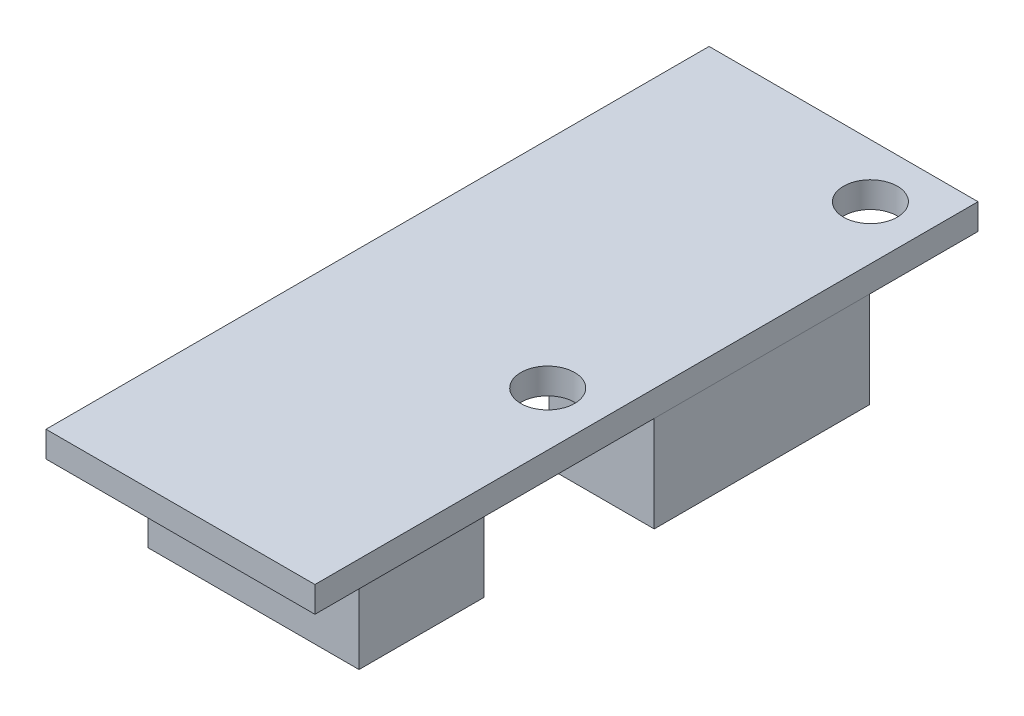
ISO-10303-21;
HEADER;
FILE_DESCRIPTION(('STEP AP214'),'2;1');
FILE_NAME('part.step','',(''),(''),'','','');
FILE_SCHEMA(('AUTOMOTIVE_DESIGN { 1 0 10303 214 1 1 1 1 }'));
ENDSEC;
DATA;
#1=APPLICATION_CONTEXT('core data for automotive mechanical design processes');
#2=APPLICATION_PROTOCOL_DEFINITION('international standard','automotive_design',2000,#1);
#3=PRODUCT_CONTEXT('',#1,'mechanical');
#4=PRODUCT('Part','Part','',(#3));
#5=PRODUCT_RELATED_PRODUCT_CATEGORY('part','',(#4));
#6=PRODUCT_DEFINITION_FORMATION('','',#4);
#7=PRODUCT_DEFINITION_CONTEXT('part definition',#1,'design');
#8=PRODUCT_DEFINITION('design','',#6,#7);
#9=PRODUCT_DEFINITION_SHAPE('','',#8);
#10=(LENGTH_UNIT() NAMED_UNIT(*) SI_UNIT(.MILLI.,.METRE.));
#11=(NAMED_UNIT(*) PLANE_ANGLE_UNIT() SI_UNIT($,.RADIAN.));
#12=(NAMED_UNIT(*) SI_UNIT($,.STERADIAN.) SOLID_ANGLE_UNIT());
#13=UNCERTAINTY_MEASURE_WITH_UNIT(LENGTH_MEASURE(1.E-05),#10,'distance_accuracy_value','');
#14=(GEOMETRIC_REPRESENTATION_CONTEXT(3) GLOBAL_UNCERTAINTY_ASSIGNED_CONTEXT((#13)) GLOBAL_UNIT_ASSIGNED_CONTEXT((#10,
#11,#12)) REPRESENTATION_CONTEXT('',''));
#15=CARTESIAN_POINT('',(0.,0.,0.));
#16=DIRECTION('',(0.,0.,1.));
#17=DIRECTION('',(1.,0.,0.));
#18=AXIS2_PLACEMENT_3D('',#15,#16,#17);
#19=CARTESIAN_POINT('',(-7.93749999999999,1.524,0.));
#20=DIRECTION('',(-1.,0.,0.));
#21=DIRECTION('',(0.,0.,1.));
#22=AXIS2_PLACEMENT_3D('',#19,#20,#21);
#23=PLANE('',#22);
#24=DIRECTION('',(0.,0.,-1.));
#25=VECTOR('',#24,1.);
#26=CARTESIAN_POINT('',(-7.93749999999999,0.,0.));
#27=LINE('',#26,#25);
#28=CARTESIAN_POINT('',(-7.93749999999999,0.,16.9164));
#29=VERTEX_POINT('',#28);
#30=CARTESIAN_POINT('',(-7.9375,0.,-22.225));
#31=VERTEX_POINT('',#30);
#32=EDGE_CURVE('E211',#29,#31,#27,.T.);
#33=ORIENTED_EDGE('',*,*,#32,.F.);
#34=DIRECTION('',(0.,-1.,0.));
#35=VECTOR('',#34,1.);
#36=CARTESIAN_POINT('',(-7.93749999999999,1.524,16.9164));
#37=LINE('',#36,#35);
#38=CARTESIAN_POINT('',(-7.93749999999999,1.524,16.9164));
#39=VERTEX_POINT('',#38);
#40=EDGE_CURVE('E11',#39,#29,#37,.T.);
#41=ORIENTED_EDGE('',*,*,#40,.F.);
#42=DIRECTION('',(0.,0.,-1.));
#43=VECTOR('',#42,1.);
#44=CARTESIAN_POINT('',(-7.93749999999999,1.524,0.));
#45=LINE('',#44,#43);
#46=CARTESIAN_POINT('',(-7.9375,1.524,-22.225));
#47=VERTEX_POINT('',#46);
#48=EDGE_CURVE('E194',#39,#47,#45,.T.);
#49=ORIENTED_EDGE('',*,*,#48,.T.);
#50=DIRECTION('',(0.,-1.,0.));
#51=VECTOR('',#50,1.);
#52=CARTESIAN_POINT('',(-7.9375,1.524,-22.225));
#53=LINE('',#52,#51);
#54=EDGE_CURVE('E205',#47,#31,#53,.T.);
#55=ORIENTED_EDGE('',*,*,#54,.T.);
#56=EDGE_LOOP('',(#33,#41,#49,#55));
#57=FACE_BOUND('',#56,.T.);
#58=ADVANCED_FACE('F32',(#57),#23,.T.);
#59=CARTESIAN_POINT('',(0.,1.524,16.9164));
#60=DIRECTION('',(0.,0.,-1.));
#61=DIRECTION('',(-1.,0.,0.));
#62=AXIS2_PLACEMENT_3D('',#59,#60,#61);
#63=PLANE('',#62);
#64=DIRECTION('',(1.,0.,0.));
#65=VECTOR('',#64,1.);
#66=CARTESIAN_POINT('',(0.,0.,16.9164));
#67=LINE('',#66,#65);
#68=CARTESIAN_POINT('',(7.9375,0.,16.9164));
#69=VERTEX_POINT('',#68);
#70=EDGE_CURVE('E214',#29,#69,#67,.T.);
#71=ORIENTED_EDGE('',*,*,#70,.T.);
#72=DIRECTION('',(0.,-1.,0.));
#73=VECTOR('',#72,1.);
#74=CARTESIAN_POINT('',(7.9375,1.524,16.9164));
#75=LINE('',#74,#73);
#76=CARTESIAN_POINT('',(7.9375,1.524,16.9164));
#77=VERTEX_POINT('',#76);
#78=EDGE_CURVE('E40',#77,#69,#75,.T.);
#79=ORIENTED_EDGE('',*,*,#78,.F.);
#80=DIRECTION('',(1.,0.,0.));
#81=VECTOR('',#80,1.);
#82=CARTESIAN_POINT('',(0.,1.524,16.9164));
#83=LINE('',#82,#81);
#84=EDGE_CURVE('E197',#39,#77,#83,.T.);
#85=ORIENTED_EDGE('',*,*,#84,.F.);
#86=ORIENTED_EDGE('',*,*,#40,.T.);
#87=EDGE_LOOP('',(#71,#79,#85,#86));
#88=FACE_BOUND('',#87,.T.);
#89=ADVANCED_FACE('F232',(#88),#63,.F.);
#90=CARTESIAN_POINT('',(7.9375,1.524,0.));
#91=DIRECTION('',(-1.,0.,0.));
#92=DIRECTION('',(0.,0.,1.));
#93=AXIS2_PLACEMENT_3D('',#90,#91,#92);
#94=PLANE('',#93);
#95=DIRECTION('',(0.,0.,-1.));
#96=VECTOR('',#95,1.);
#97=CARTESIAN_POINT('',(7.9375,0.,0.));
#98=LINE('',#97,#96);
#99=CARTESIAN_POINT('',(7.9375,0.,-22.225));
#100=VERTEX_POINT('',#99);
#101=EDGE_CURVE('E217',#69,#100,#98,.T.);
#102=ORIENTED_EDGE('',*,*,#101,.T.);
#103=DIRECTION('',(0.,-1.,0.));
#104=VECTOR('',#103,1.);
#105=CARTESIAN_POINT('',(7.9375,1.524,-22.225));
#106=LINE('',#105,#104);
#107=CARTESIAN_POINT('',(7.9375,1.524,-22.225));
#108=VERTEX_POINT('',#107);
#109=EDGE_CURVE('E223',#108,#100,#106,.T.);
#110=ORIENTED_EDGE('',*,*,#109,.F.);
#111=DIRECTION('',(0.,0.,-1.));
#112=VECTOR('',#111,1.);
#113=CARTESIAN_POINT('',(7.9375,1.524,0.));
#114=LINE('',#113,#112);
#115=EDGE_CURVE('E200',#77,#108,#114,.T.);
#116=ORIENTED_EDGE('',*,*,#115,.F.);
#117=ORIENTED_EDGE('',*,*,#78,.T.);
#118=EDGE_LOOP('',(#102,#110,#116,#117));
#119=FACE_BOUND('',#118,.T.);
#120=ADVANCED_FACE('F227',(#119),#94,.F.);
#121=CARTESIAN_POINT('',(4.76250000000001,1.524,-19.05));
#122=DIRECTION('',(0.,-1.,0.));
#123=DIRECTION('',(0.,0.,-1.));
#124=AXIS2_PLACEMENT_3D('',#121,#122,#123);
#125=CYLINDRICAL_SURFACE('',#124,1.5875);
#126=CARTESIAN_POINT('',(4.76250000000001,1.524,-19.05));
#127=DIRECTION('',(0.,1.,0.));
#128=DIRECTION('',(0.,0.,1.));
#129=AXIS2_PLACEMENT_3D('',#126,#127,#128);
#130=CIRCLE('',#129,1.5875);
#131=CARTESIAN_POINT('',(4.76250000000001,1.524,-17.4625));
#132=VERTEX_POINT('',#131);
#133=EDGE_CURVE('E190',#132,#132,#130,.T.);
#134=ORIENTED_EDGE('',*,*,#133,.T.);
#135=EDGE_LOOP('',(#134));
#136=FACE_BOUND('',#135,.T.);
#137=CARTESIAN_POINT('',(4.76250000000001,0.,-19.05));
#138=DIRECTION('',(0.,1.,0.));
#139=DIRECTION('',(0.,0.,1.));
#140=AXIS2_PLACEMENT_3D('',#137,#138,#139);
#141=CIRCLE('',#140,1.5875);
#142=CARTESIAN_POINT('',(4.76250000000001,0.,-17.4625));
#143=VERTEX_POINT('',#142);
#144=EDGE_CURVE('E208',#143,#143,#141,.T.);
#145=ORIENTED_EDGE('',*,*,#144,.F.);
#146=EDGE_LOOP('',(#145));
#147=FACE_BOUND('',#146,.T.);
#148=ADVANCED_FACE('F264',(#136,#147),#125,.F.);
#149=CARTESIAN_POINT('',(4.76250000000001,1.524,0.));
#150=DIRECTION('',(0.,-1.,0.));
#151=DIRECTION('',(0.,0.,-1.));
#152=AXIS2_PLACEMENT_3D('',#149,#150,#151);
#153=CYLINDRICAL_SURFACE('',#152,1.5875);
#154=CARTESIAN_POINT('',(4.76250000000001,1.524,0.));
#155=DIRECTION('',(0.,1.,0.));
#156=DIRECTION('',(0.,0.,1.));
#157=AXIS2_PLACEMENT_3D('',#154,#155,#156);
#158=CIRCLE('',#157,1.5875);
#159=CARTESIAN_POINT('',(4.76250000000001,1.524,1.58750000000001));
#160=VERTEX_POINT('',#159);
#161=EDGE_CURVE('E187',#160,#160,#158,.T.);
#162=ORIENTED_EDGE('',*,*,#161,.T.);
#163=EDGE_LOOP('',(#162));
#164=FACE_BOUND('',#163,.T.);
#165=CARTESIAN_POINT('',(4.76250000000001,0.,0.));
#166=DIRECTION('',(0.,1.,0.));
#167=DIRECTION('',(0.,0.,1.));
#168=AXIS2_PLACEMENT_3D('',#165,#166,#167);
#169=CIRCLE('',#168,1.5875);
#170=CARTESIAN_POINT('',(4.76250000000001,0.,1.58750000000001));
#171=VERTEX_POINT('',#170);
#172=EDGE_CURVE('E179',#171,#171,#169,.T.);
#173=ORIENTED_EDGE('',*,*,#172,.F.);
#174=EDGE_LOOP('',(#173));
#175=FACE_BOUND('',#174,.T.);
#176=ADVANCED_FACE('F34',(#164,#175),#153,.F.);
#177=CARTESIAN_POINT('',(0.,1.524,-22.225));
#178=DIRECTION('',(0.,0.,-1.));
#179=DIRECTION('',(-1.,0.,0.));
#180=AXIS2_PLACEMENT_3D('',#177,#178,#179);
#181=PLANE('',#180);
#182=DIRECTION('',(1.,0.,0.));
#183=VECTOR('',#182,1.);
#184=CARTESIAN_POINT('',(0.,0.,-22.225));
#185=LINE('',#184,#183);
#186=EDGE_CURVE('E191',#31,#100,#185,.T.);
#187=ORIENTED_EDGE('',*,*,#186,.F.);
#188=ORIENTED_EDGE('',*,*,#54,.F.);
#189=DIRECTION('',(1.,0.,0.));
#190=VECTOR('',#189,1.);
#191=CARTESIAN_POINT('',(0.,1.524,-22.225));
#192=LINE('',#191,#190);
#193=EDGE_CURVE('E202',#47,#108,#192,.T.);
#194=ORIENTED_EDGE('',*,*,#193,.T.);
#195=ORIENTED_EDGE('',*,*,#109,.T.);
#196=EDGE_LOOP('',(#187,#188,#194,#195));
#197=FACE_BOUND('',#196,.T.);
#198=ADVANCED_FACE('F241',(#197),#181,.T.);
#199=CARTESIAN_POINT('',(0.,1.524,0.));
#200=DIRECTION('',(0.,1.,0.));
#201=DIRECTION('',(0.,0.,1.));
#202=AXIS2_PLACEMENT_3D('',#199,#200,#201);
#203=PLANE('',#202);
#204=ORIENTED_EDGE('',*,*,#161,.F.);
#205=EDGE_LOOP('',(#204));
#206=FACE_BOUND('',#205,.T.);
#207=ORIENTED_EDGE('',*,*,#133,.F.);
#208=EDGE_LOOP('',(#207));
#209=FACE_BOUND('',#208,.T.);
#210=ORIENTED_EDGE('',*,*,#48,.F.);
#211=ORIENTED_EDGE('',*,*,#84,.T.);
#212=ORIENTED_EDGE('',*,*,#115,.T.);
#213=ORIENTED_EDGE('',*,*,#193,.F.);
#214=EDGE_LOOP('',(#210,#211,#212,#213));
#215=FACE_BOUND('',#214,.T.);
#216=ADVANCED_FACE('F243',(#206,#209,#215),#203,.T.);
#217=CARTESIAN_POINT('',(0.,0.,0.));
#218=DIRECTION('',(0.,1.,0.));
#219=DIRECTION('',(0.,0.,1.));
#220=AXIS2_PLACEMENT_3D('',#217,#218,#219);
#221=PLANE('',#220);
#222=DIRECTION('',(1.,0.,0.));
#223=VECTOR('',#222,1.);
#224=CARTESIAN_POINT('',(0.,0.,12.5984));
#225=LINE('',#224,#223);
#226=CARTESIAN_POINT('',(-6.223,0.,12.5984));
#227=VERTEX_POINT('',#226);
#228=CARTESIAN_POINT('',(6.223,0.,12.5984));
#229=VERTEX_POINT('',#228);
#230=EDGE_CURVE('E47',#227,#229,#225,.T.);
#231=ORIENTED_EDGE('',*,*,#230,.T.);
#232=DIRECTION('',(0.,0.,-1.));
#233=VECTOR('',#232,1.);
#234=CARTESIAN_POINT('',(6.223,0.,0.));
#235=LINE('',#234,#233);
#236=CARTESIAN_POINT('',(6.223,0.,5.2324));
#237=VERTEX_POINT('',#236);
#238=EDGE_CURVE('E124',#229,#237,#235,.T.);
#239=ORIENTED_EDGE('',*,*,#238,.T.);
#240=DIRECTION('',(1.,0.,0.));
#241=VECTOR('',#240,1.);
#242=CARTESIAN_POINT('',(0.,0.,5.2324));
#243=LINE('',#242,#241);
#244=CARTESIAN_POINT('',(-6.22299999999999,0.,5.2324));
#245=VERTEX_POINT('',#244);
#246=EDGE_CURVE('E137',#245,#237,#243,.T.);
#247=ORIENTED_EDGE('',*,*,#246,.F.);
#248=DIRECTION('',(0.,0.,-1.));
#249=VECTOR('',#248,1.);
#250=CARTESIAN_POINT('',(-6.22299999999999,0.,0.));
#251=LINE('',#250,#249);
#252=EDGE_CURVE('E52',#227,#245,#251,.T.);
#253=ORIENTED_EDGE('',*,*,#252,.F.);
#254=EDGE_LOOP('',(#231,#239,#247,#253));
#255=FACE_BOUND('',#254,.T.);
#256=DIRECTION('',(0.,0.,-1.));
#257=VECTOR('',#256,1.);
#258=CARTESIAN_POINT('',(1.65100000000001,0.,0.));
#259=LINE('',#258,#257);
#260=CARTESIAN_POINT('',(1.65100000000001,0.,-3.175));
#261=VERTEX_POINT('',#260);
#262=CARTESIAN_POINT('',(1.65100000000001,0.,-15.875));
#263=VERTEX_POINT('',#262);
#264=EDGE_CURVE('E161',#261,#263,#259,.T.);
#265=ORIENTED_EDGE('',*,*,#264,.F.);
#266=DIRECTION('',(1.,0.,0.));
#267=VECTOR('',#266,1.);
#268=CARTESIAN_POINT('',(0.,0.,-3.175));
#269=LINE('',#268,#267);
#270=CARTESIAN_POINT('',(7.87400000000001,0.,-3.175));
#271=VERTEX_POINT('',#270);
#272=EDGE_CURVE('E127',#261,#271,#269,.T.);
#273=ORIENTED_EDGE('',*,*,#272,.T.);
#274=DIRECTION('',(0.,0.,-1.));
#275=VECTOR('',#274,1.);
#276=CARTESIAN_POINT('',(7.87400000000001,0.,0.));
#277=LINE('',#276,#275);
#278=CARTESIAN_POINT('',(7.87400000000001,0.,-15.875));
#279=VERTEX_POINT('',#278);
#280=EDGE_CURVE('E171',#271,#279,#277,.T.);
#281=ORIENTED_EDGE('',*,*,#280,.T.);
#282=DIRECTION('',(1.,0.,0.));
#283=VECTOR('',#282,1.);
#284=CARTESIAN_POINT('',(0.,0.,-15.875));
#285=LINE('',#284,#283);
#286=EDGE_CURVE('E174',#263,#279,#285,.T.);
#287=ORIENTED_EDGE('',*,*,#286,.F.);
#288=EDGE_LOOP('',(#265,#273,#281,#287));
#289=FACE_BOUND('',#288,.T.);
#290=ORIENTED_EDGE('',*,*,#172,.T.);
#291=EDGE_LOOP('',(#290));
#292=FACE_BOUND('',#291,.T.);
#293=ORIENTED_EDGE('',*,*,#144,.T.);
#294=EDGE_LOOP('',(#293));
#295=FACE_BOUND('',#294,.T.);
#296=ORIENTED_EDGE('',*,*,#32,.T.);
#297=ORIENTED_EDGE('',*,*,#186,.T.);
#298=ORIENTED_EDGE('',*,*,#101,.F.);
#299=ORIENTED_EDGE('',*,*,#70,.F.);
#300=EDGE_LOOP('',(#296,#297,#298,#299));
#301=FACE_BOUND('',#300,.T.);
#302=ADVANCED_FACE('F235',(#255,#289,#292,#295,#301),#221,.F.);
#303=CARTESIAN_POINT('',(0.,-5.715,-3.175));
#304=DIRECTION('',(0.,0.,1.));
#305=DIRECTION('',(1.,0.,0.));
#306=AXIS2_PLACEMENT_3D('',#303,#304,#305);
#307=PLANE('',#306);
#308=ORIENTED_EDGE('',*,*,#272,.F.);
#309=DIRECTION('',(0.,1.,0.));
#310=VECTOR('',#309,1.);
#311=CARTESIAN_POINT('',(1.65100000000001,-5.715,-3.175));
#312=LINE('',#311,#310);
#313=CARTESIAN_POINT('',(1.65100000000001,-5.715,-3.175));
#314=VERTEX_POINT('',#313);
#315=EDGE_CURVE('E177',#314,#261,#312,.T.);
#316=ORIENTED_EDGE('',*,*,#315,.F.);
#317=DIRECTION('',(1.,0.,0.));
#318=VECTOR('',#317,1.);
#319=CARTESIAN_POINT('',(0.,-5.715,-3.175));
#320=LINE('',#319,#318);
#321=CARTESIAN_POINT('',(7.87400000000001,-5.715,-3.175));
#322=VERTEX_POINT('',#321);
#323=EDGE_CURVE('E157',#314,#322,#320,.T.);
#324=ORIENTED_EDGE('',*,*,#323,.T.);
#325=DIRECTION('',(0.,1.,0.));
#326=VECTOR('',#325,1.);
#327=CARTESIAN_POINT('',(7.87400000000001,-5.715,-3.175));
#328=LINE('',#327,#326);
#329=EDGE_CURVE('E168',#322,#271,#328,.T.);
#330=ORIENTED_EDGE('',*,*,#329,.T.);
#331=EDGE_LOOP('',(#308,#316,#324,#330));
#332=FACE_BOUND('',#331,.T.);
#333=ADVANCED_FACE('F251',(#332),#307,.T.);
#334=CARTESIAN_POINT('',(1.65100000000001,-5.715,0.));
#335=DIRECTION('',(1.,0.,0.));
#336=DIRECTION('',(0.,0.,-1.));
#337=AXIS2_PLACEMENT_3D('',#334,#335,#336);
#338=PLANE('',#337);
#339=ORIENTED_EDGE('',*,*,#264,.T.);
#340=DIRECTION('',(0.,1.,0.));
#341=VECTOR('',#340,1.);
#342=CARTESIAN_POINT('',(1.65100000000001,-5.715,-15.875));
#343=LINE('',#342,#341);
#344=CARTESIAN_POINT('',(1.65100000000001,-5.715,-15.875));
#345=VERTEX_POINT('',#344);
#346=EDGE_CURVE('E180',#345,#263,#343,.T.);
#347=ORIENTED_EDGE('',*,*,#346,.F.);
#348=DIRECTION('',(0.,0.,-1.));
#349=VECTOR('',#348,1.);
#350=CARTESIAN_POINT('',(1.65100000000001,-5.715,0.));
#351=LINE('',#350,#349);
#352=EDGE_CURVE('E166',#314,#345,#351,.T.);
#353=ORIENTED_EDGE('',*,*,#352,.F.);
#354=ORIENTED_EDGE('',*,*,#315,.T.);
#355=EDGE_LOOP('',(#339,#347,#353,#354));
#356=FACE_BOUND('',#355,.T.);
#357=ADVANCED_FACE('F334',(#356),#338,.F.);
#358=CARTESIAN_POINT('',(0.,-5.715,-15.875));
#359=DIRECTION('',(0.,0.,1.));
#360=DIRECTION('',(1.,0.,0.));
#361=AXIS2_PLACEMENT_3D('',#358,#359,#360);
#362=PLANE('',#361);
#363=ORIENTED_EDGE('',*,*,#286,.T.);
#364=DIRECTION('',(0.,1.,0.));
#365=VECTOR('',#364,1.);
#366=CARTESIAN_POINT('',(7.87400000000001,-5.715,-15.875));
#367=LINE('',#366,#365);
#368=CARTESIAN_POINT('',(7.87400000000001,-5.715,-15.875));
#369=VERTEX_POINT('',#368);
#370=EDGE_CURVE('E183',#369,#279,#367,.T.);
#371=ORIENTED_EDGE('',*,*,#370,.F.);
#372=DIRECTION('',(1.,0.,0.));
#373=VECTOR('',#372,1.);
#374=CARTESIAN_POINT('',(0.,-5.715,-15.875));
#375=LINE('',#374,#373);
#376=EDGE_CURVE('E164',#345,#369,#375,.T.);
#377=ORIENTED_EDGE('',*,*,#376,.F.);
#378=ORIENTED_EDGE('',*,*,#346,.T.);
#379=EDGE_LOOP('',(#363,#371,#377,#378));
#380=FACE_BOUND('',#379,.T.);
#381=ADVANCED_FACE('F343',(#380),#362,.F.);
#382=CARTESIAN_POINT('',(7.87400000000001,-5.715,0.));
#383=DIRECTION('',(1.,0.,0.));
#384=DIRECTION('',(0.,0.,-1.));
#385=AXIS2_PLACEMENT_3D('',#382,#383,#384);
#386=PLANE('',#385);
#387=ORIENTED_EDGE('',*,*,#280,.F.);
#388=ORIENTED_EDGE('',*,*,#329,.F.);
#389=DIRECTION('',(0.,0.,-1.));
#390=VECTOR('',#389,1.);
#391=CARTESIAN_POINT('',(7.87400000000001,-5.715,0.));
#392=LINE('',#391,#390);
#393=EDGE_CURVE('E160',#322,#369,#392,.T.);
#394=ORIENTED_EDGE('',*,*,#393,.T.);
#395=ORIENTED_EDGE('',*,*,#370,.T.);
#396=EDGE_LOOP('',(#387,#388,#394,#395));
#397=FACE_BOUND('',#396,.T.);
#398=ADVANCED_FACE('F353',(#397),#386,.T.);
#399=CARTESIAN_POINT('',(0.,-5.715,0.));
#400=DIRECTION('',(0.,1.,0.));
#401=DIRECTION('',(0.,0.,1.));
#402=AXIS2_PLACEMENT_3D('',#399,#400,#401);
#403=PLANE('',#402);
#404=ORIENTED_EDGE('',*,*,#323,.F.);
#405=ORIENTED_EDGE('',*,*,#352,.T.);
#406=ORIENTED_EDGE('',*,*,#376,.T.);
#407=ORIENTED_EDGE('',*,*,#393,.F.);
#408=EDGE_LOOP('',(#404,#405,#406,#407));
#409=FACE_BOUND('',#408,.T.);
#410=ADVANCED_FACE('F363',(#409),#403,.F.);
#411=CARTESIAN_POINT('',(6.223,-5.842,0.));
#412=DIRECTION('',(1.,0.,0.));
#413=DIRECTION('',(0.,0.,-1.));
#414=AXIS2_PLACEMENT_3D('',#411,#412,#413);
#415=PLANE('',#414);
#416=ORIENTED_EDGE('',*,*,#238,.F.);
#417=DIRECTION('',(0.,1.,0.));
#418=VECTOR('',#417,1.);
#419=CARTESIAN_POINT('',(6.223,-5.842,12.5984));
#420=LINE('',#419,#418);
#421=CARTESIAN_POINT('',(6.223,-5.842,12.5984));
#422=VERTEX_POINT('',#421);
#423=EDGE_CURVE('E119',#422,#229,#420,.T.);
#424=ORIENTED_EDGE('',*,*,#423,.F.);
#425=DIRECTION('',(0.,0.,-1.));
#426=VECTOR('',#425,1.);
#427=CARTESIAN_POINT('',(6.223,-5.842,0.));
#428=LINE('',#427,#426);
#429=CARTESIAN_POINT('',(6.223,-5.842,5.2324));
#430=VERTEX_POINT('',#429);
#431=EDGE_CURVE('E123',#422,#430,#428,.T.);
#432=ORIENTED_EDGE('',*,*,#431,.T.);
#433=DIRECTION('',(0.,1.,0.));
#434=VECTOR('',#433,1.);
#435=CARTESIAN_POINT('',(6.223,-5.842,5.2324));
#436=LINE('',#435,#434);
#437=EDGE_CURVE('E146',#430,#237,#436,.T.);
#438=ORIENTED_EDGE('',*,*,#437,.T.);
#439=EDGE_LOOP('',(#416,#424,#432,#438));
#440=FACE_BOUND('',#439,.T.);
#441=ADVANCED_FACE('F121',(#440),#415,.T.);
#442=CARTESIAN_POINT('',(0.,-5.842,12.5984));
#443=DIRECTION('',(0.,0.,1.));
#444=DIRECTION('',(1.,0.,0.));
#445=AXIS2_PLACEMENT_3D('',#442,#443,#444);
#446=PLANE('',#445);
#447=ORIENTED_EDGE('',*,*,#230,.F.);
#448=DIRECTION('',(0.,1.,0.));
#449=VECTOR('',#448,1.);
#450=CARTESIAN_POINT('',(-6.223,-5.842,12.5984));
#451=LINE('',#450,#449);
#452=CARTESIAN_POINT('',(-6.223,-5.842,12.5984));
#453=VERTEX_POINT('',#452);
#454=EDGE_CURVE('E128',#453,#227,#451,.T.);
#455=ORIENTED_EDGE('',*,*,#454,.F.);
#456=DIRECTION('',(1.,0.,0.));
#457=VECTOR('',#456,1.);
#458=CARTESIAN_POINT('',(0.,-5.842,12.5984));
#459=LINE('',#458,#457);
#460=EDGE_CURVE('E133',#453,#422,#459,.T.);
#461=ORIENTED_EDGE('',*,*,#460,.T.);
#462=ORIENTED_EDGE('',*,*,#423,.T.);
#463=EDGE_LOOP('',(#447,#455,#461,#462));
#464=FACE_BOUND('',#463,.T.);
#465=ADVANCED_FACE('F139',(#464),#446,.T.);
#466=CARTESIAN_POINT('',(-6.22299999999999,-5.842,0.));
#467=DIRECTION('',(1.,0.,0.));
#468=DIRECTION('',(0.,0.,-1.));
#469=AXIS2_PLACEMENT_3D('',#466,#467,#468);
#470=PLANE('',#469);
#471=ORIENTED_EDGE('',*,*,#252,.T.);
#472=DIRECTION('',(0.,1.,0.));
#473=VECTOR('',#472,1.);
#474=CARTESIAN_POINT('',(-6.22299999999999,-5.842,5.2324));
#475=LINE('',#474,#473);
#476=CARTESIAN_POINT('',(-6.22299999999999,-5.842,5.2324));
#477=VERTEX_POINT('',#476);
#478=EDGE_CURVE('E153',#477,#245,#475,.T.);
#479=ORIENTED_EDGE('',*,*,#478,.F.);
#480=DIRECTION('',(0.,0.,-1.));
#481=VECTOR('',#480,1.);
#482=CARTESIAN_POINT('',(-6.22299999999999,-5.842,0.));
#483=LINE('',#482,#481);
#484=EDGE_CURVE('E141',#453,#477,#483,.T.);
#485=ORIENTED_EDGE('',*,*,#484,.F.);
#486=ORIENTED_EDGE('',*,*,#454,.T.);
#487=EDGE_LOOP('',(#471,#479,#485,#486));
#488=FACE_BOUND('',#487,.T.);
#489=ADVANCED_FACE('F393',(#488),#470,.F.);
#490=CARTESIAN_POINT('',(0.,-5.842,5.2324));
#491=DIRECTION('',(0.,0.,1.));
#492=DIRECTION('',(1.,0.,0.));
#493=AXIS2_PLACEMENT_3D('',#490,#491,#492);
#494=PLANE('',#493);
#495=ORIENTED_EDGE('',*,*,#246,.T.);
#496=ORIENTED_EDGE('',*,*,#437,.F.);
#497=DIRECTION('',(1.,0.,0.));
#498=VECTOR('',#497,1.);
#499=CARTESIAN_POINT('',(0.,-5.842,5.2324));
#500=LINE('',#499,#498);
#501=EDGE_CURVE('E135',#477,#430,#500,.T.);
#502=ORIENTED_EDGE('',*,*,#501,.F.);
#503=ORIENTED_EDGE('',*,*,#478,.T.);
#504=EDGE_LOOP('',(#495,#496,#502,#503));
#505=FACE_BOUND('',#504,.T.);
#506=ADVANCED_FACE('F402',(#505),#494,.F.);
#507=CARTESIAN_POINT('',(0.,-5.842,0.));
#508=DIRECTION('',(0.,-1.,0.));
#509=DIRECTION('',(0.,0.,-1.));
#510=AXIS2_PLACEMENT_3D('',#507,#508,#509);
#511=PLANE('',#510);
#512=ORIENTED_EDGE('',*,*,#431,.F.);
#513=ORIENTED_EDGE('',*,*,#460,.F.);
#514=ORIENTED_EDGE('',*,*,#484,.T.);
#515=ORIENTED_EDGE('',*,*,#501,.T.);
#516=EDGE_LOOP('',(#512,#513,#514,#515));
#517=FACE_BOUND('',#516,.T.);
#518=ADVANCED_FACE('F132',(#517),#511,.T.);
#519=CLOSED_SHELL('',(#58,#89,#120,#148,#176,#198,#216,#302,#333,#357,#381,#398,#410,#441,#465,
#489,#506,#518));
#520=MANIFOLD_SOLID_BREP('B2',#519);
#521=ADVANCED_BREP_SHAPE_REPRESENTATION('',(#18,#520),#14);
#522=SHAPE_DEFINITION_REPRESENTATION(#9,#521);
ENDSEC;
END-ISO-10303-21;
